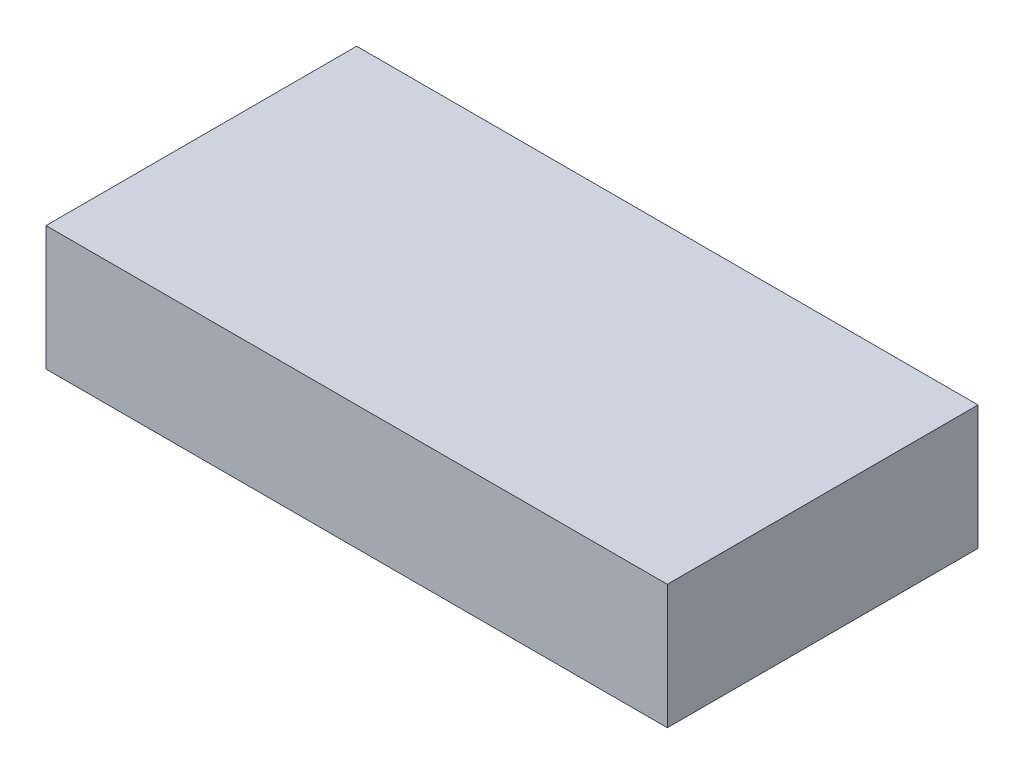
ISO-10303-21;
HEADER;
FILE_DESCRIPTION(('STEP AP214'),'2;1');
FILE_NAME('part.step','',(''),(''),'','','');
FILE_SCHEMA(('AUTOMOTIVE_DESIGN { 1 0 10303 214 1 1 1 1 }'));
ENDSEC;
DATA;
#1=APPLICATION_CONTEXT('core data for automotive mechanical design processes');
#2=APPLICATION_PROTOCOL_DEFINITION('international standard','automotive_design',2000,#1);
#3=PRODUCT_CONTEXT('',#1,'mechanical');
#4=PRODUCT('Part','Part','',(#3));
#5=PRODUCT_RELATED_PRODUCT_CATEGORY('part','',(#4));
#6=PRODUCT_DEFINITION_FORMATION('','',#4);
#7=PRODUCT_DEFINITION_CONTEXT('part definition',#1,'design');
#8=PRODUCT_DEFINITION('design','',#6,#7);
#9=PRODUCT_DEFINITION_SHAPE('','',#8);
#10=(LENGTH_UNIT() NAMED_UNIT(*) SI_UNIT(.MILLI.,.METRE.));
#11=(NAMED_UNIT(*) PLANE_ANGLE_UNIT() SI_UNIT($,.RADIAN.));
#12=(NAMED_UNIT(*) SI_UNIT($,.STERADIAN.) SOLID_ANGLE_UNIT());
#13=UNCERTAINTY_MEASURE_WITH_UNIT(LENGTH_MEASURE(1.E-05),#10,'distance_accuracy_value','');
#14=(GEOMETRIC_REPRESENTATION_CONTEXT(3) GLOBAL_UNCERTAINTY_ASSIGNED_CONTEXT((#13)) GLOBAL_UNIT_ASSIGNED_CONTEXT((#10,
#11,#12)) REPRESENTATION_CONTEXT('',''));
#15=CARTESIAN_POINT('',(0.,0.,0.));
#16=DIRECTION('',(0.,0.,1.));
#17=DIRECTION('',(1.,0.,0.));
#18=AXIS2_PLACEMENT_3D('',#15,#16,#17);
#19=CARTESIAN_POINT('',(-5.,1.,-2.5));
#20=DIRECTION('',(0.,0.,-1.));
#21=DIRECTION('',(-1.,0.,0.));
#22=AXIS2_PLACEMENT_3D('',#19,#20,#21);
#23=PLANE('',#22);
#24=DIRECTION('',(0.,-1.,0.));
#25=VECTOR('',#24,1.);
#26=CARTESIAN_POINT('',(5.,1.,-2.5));
#27=LINE('',#26,#25);
#28=CARTESIAN_POINT('',(5.,1.,-2.5));
#29=VERTEX_POINT('',#28);
#30=CARTESIAN_POINT('',(5.,-1.,-2.5));
#31=VERTEX_POINT('',#30);
#32=EDGE_CURVE('E36',#29,#31,#27,.T.);
#33=ORIENTED_EDGE('',*,*,#32,.T.);
#34=DIRECTION('',(1.,0.,0.));
#35=VECTOR('',#34,1.);
#36=CARTESIAN_POINT('',(0.,-1.,-2.5));
#37=LINE('',#36,#35);
#38=CARTESIAN_POINT('',(-5.,-1.,-2.5));
#39=VERTEX_POINT('',#38);
#40=EDGE_CURVE('E135',#39,#31,#37,.T.);
#41=ORIENTED_EDGE('',*,*,#40,.F.);
#42=DIRECTION('',(0.,-1.,0.));
#43=VECTOR('',#42,1.);
#44=CARTESIAN_POINT('',(-5.,1.,-2.5));
#45=LINE('',#44,#43);
#46=CARTESIAN_POINT('',(-5.,1.,-2.5));
#47=VERTEX_POINT('',#46);
#48=EDGE_CURVE('E11',#47,#39,#45,.T.);
#49=ORIENTED_EDGE('',*,*,#48,.F.);
#50=DIRECTION('',(1.,0.,0.));
#51=VECTOR('',#50,1.);
#52=CARTESIAN_POINT('',(-5.,1.,-2.5));
#53=LINE('',#52,#51);
#54=EDGE_CURVE('E148',#47,#29,#53,.T.);
#55=ORIENTED_EDGE('',*,*,#54,.T.);
#56=EDGE_LOOP('',(#33,#41,#49,#55));
#57=FACE_BOUND('',#56,.T.);
#58=ADVANCED_FACE('F33',(#57),#23,.T.);
#59=CARTESIAN_POINT('',(-5.,1.,-2.5));
#60=DIRECTION('',(1.,0.,0.));
#61=DIRECTION('',(0.,0.,-1.));
#62=AXIS2_PLACEMENT_3D('',#59,#60,#61);
#63=PLANE('',#62);
#64=ORIENTED_EDGE('',*,*,#48,.T.);
#65=DIRECTION('',(0.,0.,1.));
#66=VECTOR('',#65,1.);
#67=CARTESIAN_POINT('',(-5.,-1.,0.));
#68=LINE('',#67,#66);
#69=CARTESIAN_POINT('',(-5.,-1.,2.5));
#70=VERTEX_POINT('',#69);
#71=EDGE_CURVE('E138',#39,#70,#68,.T.);
#72=ORIENTED_EDGE('',*,*,#71,.T.);
#73=DIRECTION('',(0.,-1.,0.));
#74=VECTOR('',#73,1.);
#75=CARTESIAN_POINT('',(-5.,1.,2.5));
#76=LINE('',#75,#74);
#77=CARTESIAN_POINT('',(-5.,1.,2.5));
#78=VERTEX_POINT('',#77);
#79=EDGE_CURVE('E41',#78,#70,#76,.T.);
#80=ORIENTED_EDGE('',*,*,#79,.F.);
#81=DIRECTION('',(0.,0.,1.));
#82=VECTOR('',#81,1.);
#83=CARTESIAN_POINT('',(-5.,1.,-2.5));
#84=LINE('',#83,#82);
#85=EDGE_CURVE('E158',#47,#78,#84,.T.);
#86=ORIENTED_EDGE('',*,*,#85,.F.);
#87=EDGE_LOOP('',(#64,#72,#80,#86));
#88=FACE_BOUND('',#87,.T.);
#89=ADVANCED_FACE('F178',(#88),#63,.F.);
#90=CARTESIAN_POINT('',(-5.,1.,2.5));
#91=DIRECTION('',(0.,0.,-1.));
#92=DIRECTION('',(-1.,0.,0.));
#93=AXIS2_PLACEMENT_3D('',#90,#91,#92);
#94=PLANE('',#93);
#95=ORIENTED_EDGE('',*,*,#79,.T.);
#96=DIRECTION('',(1.,0.,0.));
#97=VECTOR('',#96,1.);
#98=CARTESIAN_POINT('',(0.,-1.,2.5));
#99=LINE('',#98,#97);
#100=CARTESIAN_POINT('',(5.,-1.,2.5));
#101=VERTEX_POINT('',#100);
#102=EDGE_CURVE('E119',#70,#101,#99,.T.);
#103=ORIENTED_EDGE('',*,*,#102,.T.);
#104=DIRECTION('',(0.,-1.,0.));
#105=VECTOR('',#104,1.);
#106=CARTESIAN_POINT('',(5.,1.,2.5));
#107=LINE('',#106,#105);
#108=CARTESIAN_POINT('',(5.,1.,2.5));
#109=VERTEX_POINT('',#108);
#110=EDGE_CURVE('E160',#109,#101,#107,.T.);
#111=ORIENTED_EDGE('',*,*,#110,.F.);
#112=DIRECTION('',(1.,0.,0.));
#113=VECTOR('',#112,1.);
#114=CARTESIAN_POINT('',(-5.,1.,2.5));
#115=LINE('',#114,#113);
#116=EDGE_CURVE('E156',#78,#109,#115,.T.);
#117=ORIENTED_EDGE('',*,*,#116,.F.);
#118=EDGE_LOOP('',(#95,#103,#111,#117));
#119=FACE_BOUND('',#118,.T.);
#120=ADVANCED_FACE('F171',(#119),#94,.F.);
#121=CARTESIAN_POINT('',(5.,1.,-2.5));
#122=DIRECTION('',(1.,0.,0.));
#123=DIRECTION('',(0.,0.,-1.));
#124=AXIS2_PLACEMENT_3D('',#121,#122,#123);
#125=PLANE('',#124);
#126=ORIENTED_EDGE('',*,*,#110,.T.);
#127=DIRECTION('',(0.,0.,1.));
#128=VECTOR('',#127,1.);
#129=CARTESIAN_POINT('',(5.,-1.,0.));
#130=LINE('',#129,#128);
#131=EDGE_CURVE('E132',#31,#101,#130,.T.);
#132=ORIENTED_EDGE('',*,*,#131,.F.);
#133=ORIENTED_EDGE('',*,*,#32,.F.);
#134=DIRECTION('',(0.,0.,1.));
#135=VECTOR('',#134,1.);
#136=CARTESIAN_POINT('',(5.,1.,-2.5));
#137=LINE('',#136,#135);
#138=EDGE_CURVE('E153',#29,#109,#137,.T.);
#139=ORIENTED_EDGE('',*,*,#138,.T.);
#140=EDGE_LOOP('',(#126,#132,#133,#139));
#141=FACE_BOUND('',#140,.T.);
#142=ADVANCED_FACE('F168',(#141),#125,.T.);
#143=CARTESIAN_POINT('',(0.,1.,0.));
#144=DIRECTION('',(0.,-1.,0.));
#145=DIRECTION('',(0.,0.,-1.));
#146=AXIS2_PLACEMENT_3D('',#143,#144,#145);
#147=PLANE('',#146);
#148=ORIENTED_EDGE('',*,*,#54,.F.);
#149=ORIENTED_EDGE('',*,*,#85,.T.);
#150=ORIENTED_EDGE('',*,*,#116,.T.);
#151=ORIENTED_EDGE('',*,*,#138,.F.);
#152=EDGE_LOOP('',(#148,#149,#150,#151));
#153=FACE_BOUND('',#152,.T.);
#154=ADVANCED_FACE('F170',(#153),#147,.F.);
#155=CARTESIAN_POINT('',(4.,-1.,0.));
#156=DIRECTION('',(1.,0.,0.));
#157=DIRECTION('',(0.,0.,-1.));
#158=AXIS2_PLACEMENT_3D('',#155,#156,#157);
#159=PLANE('',#158);
#160=DIRECTION('',(0.,0.,-1.));
#161=VECTOR('',#160,1.);
#162=CARTESIAN_POINT('',(4.,0.,0.));
#163=LINE('',#162,#161);
#164=CARTESIAN_POINT('',(4.,0.,1.5));
#165=VERTEX_POINT('',#164);
#166=CARTESIAN_POINT('',(4.,0.,-1.5));
#167=VERTEX_POINT('',#166);
#168=EDGE_CURVE('E143',#165,#167,#163,.T.);
#169=ORIENTED_EDGE('',*,*,#168,.T.);
#170=DIRECTION('',(0.,1.,0.));
#171=VECTOR('',#170,1.);
#172=CARTESIAN_POINT('',(4.,-1.,-1.5));
#173=LINE('',#172,#171);
#174=CARTESIAN_POINT('',(4.,-1.,-1.5));
#175=VERTEX_POINT('',#174);
#176=EDGE_CURVE('E122',#175,#167,#173,.T.);
#177=ORIENTED_EDGE('',*,*,#176,.F.);
#178=DIRECTION('',(0.,0.,-1.));
#179=VECTOR('',#178,1.);
#180=CARTESIAN_POINT('',(4.,-1.,0.));
#181=LINE('',#180,#179);
#182=CARTESIAN_POINT('',(4.,-1.,1.5));
#183=VERTEX_POINT('',#182);
#184=EDGE_CURVE('E104',#183,#175,#181,.T.);
#185=ORIENTED_EDGE('',*,*,#184,.F.);
#186=DIRECTION('',(0.,1.,0.));
#187=VECTOR('',#186,1.);
#188=CARTESIAN_POINT('',(4.,-1.,1.5));
#189=LINE('',#188,#187);
#190=EDGE_CURVE('E111',#183,#165,#189,.T.);
#191=ORIENTED_EDGE('',*,*,#190,.T.);
#192=EDGE_LOOP('',(#169,#177,#185,#191));
#193=FACE_BOUND('',#192,.T.);
#194=ADVANCED_FACE('F121',(#193),#159,.F.);
#195=CARTESIAN_POINT('',(0.,-1.,-1.5));
#196=DIRECTION('',(0.,0.,1.));
#197=DIRECTION('',(1.,0.,0.));
#198=AXIS2_PLACEMENT_3D('',#195,#196,#197);
#199=PLANE('',#198);
#200=DIRECTION('',(1.,0.,0.));
#201=VECTOR('',#200,1.);
#202=CARTESIAN_POINT('',(0.,0.,-1.5));
#203=LINE('',#202,#201);
#204=CARTESIAN_POINT('',(-4.,0.,-1.5));
#205=VERTEX_POINT('',#204);
#206=EDGE_CURVE('E124',#205,#167,#203,.T.);
#207=ORIENTED_EDGE('',*,*,#206,.F.);
#208=DIRECTION('',(0.,1.,0.));
#209=VECTOR('',#208,1.);
#210=CARTESIAN_POINT('',(-4.,-1.,-1.5));
#211=LINE('',#210,#209);
#212=CARTESIAN_POINT('',(-4.,-1.,-1.5));
#213=VERTEX_POINT('',#212);
#214=EDGE_CURVE('E149',#213,#205,#211,.T.);
#215=ORIENTED_EDGE('',*,*,#214,.F.);
#216=DIRECTION('',(1.,0.,0.));
#217=VECTOR('',#216,1.);
#218=CARTESIAN_POINT('',(0.,-1.,-1.5));
#219=LINE('',#218,#217);
#220=EDGE_CURVE('E130',#213,#175,#219,.T.);
#221=ORIENTED_EDGE('',*,*,#220,.T.);
#222=ORIENTED_EDGE('',*,*,#176,.T.);
#223=EDGE_LOOP('',(#207,#215,#221,#222));
#224=FACE_BOUND('',#223,.T.);
#225=ADVANCED_FACE('F196',(#224),#199,.T.);
#226=CARTESIAN_POINT('',(-4.,-1.,0.));
#227=DIRECTION('',(1.,0.,0.));
#228=DIRECTION('',(0.,0.,-1.));
#229=AXIS2_PLACEMENT_3D('',#226,#227,#228);
#230=PLANE('',#229);
#231=DIRECTION('',(0.,0.,-1.));
#232=VECTOR('',#231,1.);
#233=CARTESIAN_POINT('',(-4.,0.,0.));
#234=LINE('',#233,#232);
#235=CARTESIAN_POINT('',(-4.,0.,1.5));
#236=VERTEX_POINT('',#235);
#237=EDGE_CURVE('E49',#236,#205,#234,.T.);
#238=ORIENTED_EDGE('',*,*,#237,.F.);
#239=DIRECTION('',(0.,1.,0.));
#240=VECTOR('',#239,1.);
#241=CARTESIAN_POINT('',(-4.,-1.,1.5));
#242=LINE('',#241,#240);
#243=CARTESIAN_POINT('',(-4.,-1.,1.5));
#244=VERTEX_POINT('',#243);
#245=EDGE_CURVE('E118',#244,#236,#242,.T.);
#246=ORIENTED_EDGE('',*,*,#245,.F.);
#247=DIRECTION('',(0.,0.,-1.));
#248=VECTOR('',#247,1.);
#249=CARTESIAN_POINT('',(-4.,-1.,0.));
#250=LINE('',#249,#248);
#251=EDGE_CURVE('E107',#244,#213,#250,.T.);
#252=ORIENTED_EDGE('',*,*,#251,.T.);
#253=ORIENTED_EDGE('',*,*,#214,.T.);
#254=EDGE_LOOP('',(#238,#246,#252,#253));
#255=FACE_BOUND('',#254,.T.);
#256=ADVANCED_FACE('F199',(#255),#230,.T.);
#257=CARTESIAN_POINT('',(0.,-1.,1.5));
#258=DIRECTION('',(0.,0.,1.));
#259=DIRECTION('',(1.,0.,0.));
#260=AXIS2_PLACEMENT_3D('',#257,#258,#259);
#261=PLANE('',#260);
#262=DIRECTION('',(1.,0.,0.));
#263=VECTOR('',#262,1.);
#264=CARTESIAN_POINT('',(0.,0.,1.5));
#265=LINE('',#264,#263);
#266=EDGE_CURVE('E114',#236,#165,#265,.T.);
#267=ORIENTED_EDGE('',*,*,#266,.T.);
#268=ORIENTED_EDGE('',*,*,#190,.F.);
#269=DIRECTION('',(1.,0.,0.));
#270=VECTOR('',#269,1.);
#271=CARTESIAN_POINT('',(0.,-1.,1.5));
#272=LINE('',#271,#270);
#273=EDGE_CURVE('E98',#244,#183,#272,.T.);
#274=ORIENTED_EDGE('',*,*,#273,.F.);
#275=ORIENTED_EDGE('',*,*,#245,.T.);
#276=EDGE_LOOP('',(#267,#268,#274,#275));
#277=FACE_BOUND('',#276,.T.);
#278=ADVANCED_FACE('F112',(#277),#261,.F.);
#279=CARTESIAN_POINT('',(0.,-1.,0.));
#280=DIRECTION('',(0.,1.,0.));
#281=DIRECTION('',(0.,0.,1.));
#282=AXIS2_PLACEMENT_3D('',#279,#280,#281);
#283=PLANE('',#282);
#284=ORIENTED_EDGE('',*,*,#184,.T.);
#285=ORIENTED_EDGE('',*,*,#220,.F.);
#286=ORIENTED_EDGE('',*,*,#251,.F.);
#287=ORIENTED_EDGE('',*,*,#273,.T.);
#288=EDGE_LOOP('',(#284,#285,#286,#287));
#289=FACE_BOUND('',#288,.T.);
#290=ORIENTED_EDGE('',*,*,#131,.T.);
#291=ORIENTED_EDGE('',*,*,#102,.F.);
#292=ORIENTED_EDGE('',*,*,#71,.F.);
#293=ORIENTED_EDGE('',*,*,#40,.T.);
#294=EDGE_LOOP('',(#290,#291,#292,#293));
#295=FACE_BOUND('',#294,.T.);
#296=ADVANCED_FACE('F100',(#289,#295),#283,.F.);
#297=CARTESIAN_POINT('',(0.,0.,0.));
#298=DIRECTION('',(0.,-1.,0.));
#299=DIRECTION('',(0.,0.,-1.));
#300=AXIS2_PLACEMENT_3D('',#297,#298,#299);
#301=PLANE('',#300);
#302=ORIENTED_EDGE('',*,*,#206,.T.);
#303=ORIENTED_EDGE('',*,*,#168,.F.);
#304=ORIENTED_EDGE('',*,*,#266,.F.);
#305=ORIENTED_EDGE('',*,*,#237,.T.);
#306=EDGE_LOOP('',(#302,#303,#304,#305));
#307=FACE_BOUND('',#306,.T.);
#308=ADVANCED_FACE('F190',(#307),#301,.T.);
#309=CLOSED_SHELL('',(#58,#89,#120,#142,#154,#194,#225,#256,#278,#296,#308));
#310=MANIFOLD_SOLID_BREP('B2',#309);
#311=ADVANCED_BREP_SHAPE_REPRESENTATION('',(#18,#310),#14);
#312=SHAPE_DEFINITION_REPRESENTATION(#9,#311);
ENDSEC;
END-ISO-10303-21;
